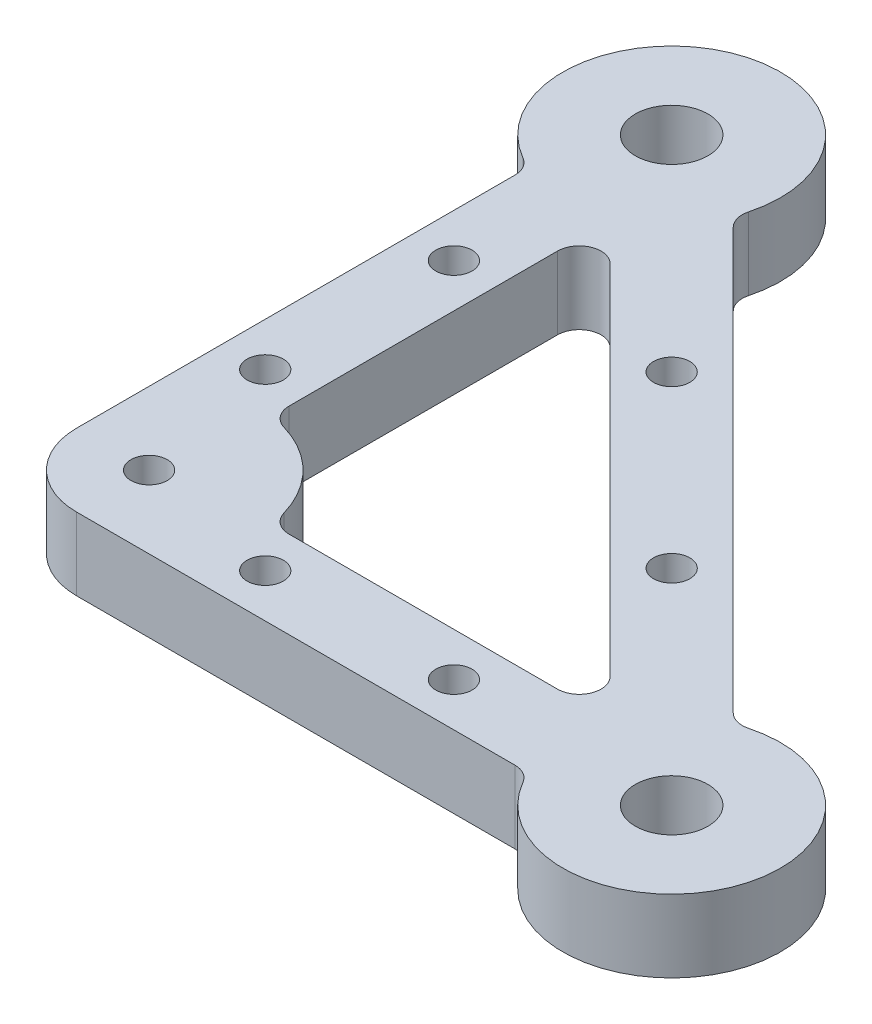
ISO-10303-21;
HEADER;
FILE_DESCRIPTION(('STEP AP214'),'2;1');
FILE_NAME('part.step','',(''),(''),'','','');
FILE_SCHEMA(('AUTOMOTIVE_DESIGN { 1 0 10303 214 1 1 1 1 }'));
ENDSEC;
DATA;
#1=APPLICATION_CONTEXT('core data for automotive mechanical design processes');
#2=APPLICATION_PROTOCOL_DEFINITION('international standard','automotive_design',2000,#1);
#3=PRODUCT_CONTEXT('',#1,'mechanical');
#4=PRODUCT('Part','Part','',(#3));
#5=PRODUCT_RELATED_PRODUCT_CATEGORY('part','',(#4));
#6=PRODUCT_DEFINITION_FORMATION('','',#4);
#7=PRODUCT_DEFINITION_CONTEXT('part definition',#1,'design');
#8=PRODUCT_DEFINITION('design','',#6,#7);
#9=PRODUCT_DEFINITION_SHAPE('','',#8);
#10=(LENGTH_UNIT() NAMED_UNIT(*) SI_UNIT(.MILLI.,.METRE.));
#11=(NAMED_UNIT(*) PLANE_ANGLE_UNIT() SI_UNIT($,.RADIAN.));
#12=(NAMED_UNIT(*) SI_UNIT($,.STERADIAN.) SOLID_ANGLE_UNIT());
#13=UNCERTAINTY_MEASURE_WITH_UNIT(LENGTH_MEASURE(1.E-05),#10,'distance_accuracy_value','');
#14=(GEOMETRIC_REPRESENTATION_CONTEXT(3) GLOBAL_UNCERTAINTY_ASSIGNED_CONTEXT((#13)) GLOBAL_UNIT_ASSIGNED_CONTEXT((#10,
#11,#12)) REPRESENTATION_CONTEXT('',''));
#15=CARTESIAN_POINT('',(0.,0.,0.));
#16=DIRECTION('',(0.,0.,1.));
#17=DIRECTION('',(1.,0.,0.));
#18=AXIS2_PLACEMENT_3D('',#15,#16,#17);
#19=CARTESIAN_POINT('',(3.99999999999999,10.,-4.));
#20=DIRECTION('',(0.,-1.,0.));
#21=DIRECTION('',(0.,0.,-1.));
#22=AXIS2_PLACEMENT_3D('',#19,#20,#21);
#23=PLANE('',#22);
#24=CARTESIAN_POINT('',(80.,10.,0.));
#25=DIRECTION('',(0.,1.,0.));
#26=DIRECTION('',(0.,0.,1.));
#27=AXIS2_PLACEMENT_3D('',#24,#25,#26);
#28=CIRCLE('',#27,5.);
#29=CARTESIAN_POINT('',(80.,10.,5.));
#30=VERTEX_POINT('',#29);
#31=EDGE_CURVE('E262',#30,#30,#28,.T.);
#32=ORIENTED_EDGE('',*,*,#31,.F.);
#33=EDGE_LOOP('',(#32));
#34=FACE_BOUND('',#33,.T.);
#35=CARTESIAN_POINT('',(0.,10.,-80.));
#36=DIRECTION('',(0.,1.,0.));
#37=DIRECTION('',(0.,0.,1.));
#38=AXIS2_PLACEMENT_3D('',#35,#36,#37);
#39=CIRCLE('',#38,5.);
#40=CARTESIAN_POINT('',(0.,10.,-75.));
#41=VERTEX_POINT('',#40);
#42=EDGE_CURVE('E270',#41,#41,#39,.T.);
#43=ORIENTED_EDGE('',*,*,#42,.F.);
#44=EDGE_LOOP('',(#43));
#45=FACE_BOUND('',#44,.T.);
#46=CARTESIAN_POINT('',(3.99999999999999,10.,-4.));
#47=DIRECTION('',(0.,1.,0.));
#48=DIRECTION('',(0.,0.,-1.));
#49=AXIS2_PLACEMENT_3D('',#46,#47,#48);
#50=CIRCLE('',#49,10.);
#51=CARTESIAN_POINT('',(-6.,10.,-4.00000000000007));
#52=VERTEX_POINT('',#51);
#53=CARTESIAN_POINT('',(4.00000000000007,10.,6.));
#54=VERTEX_POINT('',#53);
#55=EDGE_CURVE('E278',#52,#54,#50,.T.);
#56=ORIENTED_EDGE('',*,*,#55,.T.);
#57=DIRECTION('',(1.,0.,0.));
#58=VECTOR('',#57,1.);
#59=CARTESIAN_POINT('',(64.4115427318801,10.,6.));
#60=LINE('',#59,#58);
#61=CARTESIAN_POINT('',(64.4115427318801,10.,6.));
#62=VERTEX_POINT('',#61);
#63=EDGE_CURVE('E282',#54,#62,#60,.T.);
#64=ORIENTED_EDGE('',*,*,#63,.T.);
#65=CARTESIAN_POINT('',(64.4115427318801,10.,9.));
#66=DIRECTION('',(0.,-1.,0.));
#67=DIRECTION('',(0.,0.,-1.));
#68=AXIS2_PLACEMENT_3D('',#65,#66,#67);
#69=CIRCLE('',#68,3.00000000000001);
#70=CARTESIAN_POINT('',(67.0096189432334,10.,7.5));
#71=VERTEX_POINT('',#70);
#72=EDGE_CURVE('E286',#62,#71,#69,.T.);
#73=ORIENTED_EDGE('',*,*,#72,.T.);
#74=CARTESIAN_POINT('',(80.,10.,0.));
#75=DIRECTION('',(0.,1.,0.));
#76=DIRECTION('',(0.,0.,1.));
#77=AXIS2_PLACEMENT_3D('',#74,#75,#76);
#78=CIRCLE('',#77,15.);
#79=CARTESIAN_POINT('',(76.1177143234622,10.,-14.488887394336));
#80=VERTEX_POINT('',#79);
#81=EDGE_CURVE('E289',#71,#80,#78,.T.);
#82=ORIENTED_EDGE('',*,*,#81,.T.);
#83=CARTESIAN_POINT('',(75.3412571881546,10.,-17.3866648732032));
#84=DIRECTION('',(0.,-1.,0.));
#85=DIRECTION('',(0.,0.,1.));
#86=AXIS2_PLACEMENT_3D('',#83,#84,#85);
#87=CIRCLE('',#86,3.);
#88=CARTESIAN_POINT('',(73.219936844595,10.,-15.2653445296436));
#89=VERTEX_POINT('',#88);
#90=EDGE_CURVE('E292',#80,#89,#87,.T.);
#91=ORIENTED_EDGE('',*,*,#90,.T.);
#92=DIRECTION('',(-0.707106781186547,0.,-0.707106781186547));
#93=VECTOR('',#92,1.);
#94=CARTESIAN_POINT('',(73.219936844595,10.,-15.2653445296436));
#95=LINE('',#94,#93);
#96=CARTESIAN_POINT('',(15.2653445296436,10.,-73.219936844595));
#97=VERTEX_POINT('',#96);
#98=EDGE_CURVE('E295',#89,#97,#95,.T.);
#99=ORIENTED_EDGE('',*,*,#98,.T.);
#100=CARTESIAN_POINT('',(17.3866648732032,10.,-75.3412571881546));
#101=DIRECTION('',(0.,-1.,0.));
#102=DIRECTION('',(0.,0.,-1.));
#103=AXIS2_PLACEMENT_3D('',#100,#101,#102);
#104=CIRCLE('',#103,3.);
#105=CARTESIAN_POINT('',(14.488887394336,10.,-76.1177143234622));
#106=VERTEX_POINT('',#105);
#107=EDGE_CURVE('E298',#97,#106,#104,.T.);
#108=ORIENTED_EDGE('',*,*,#107,.T.);
#109=CARTESIAN_POINT('',(0.,10.,-80.));
#110=DIRECTION('',(0.,1.,0.));
#111=DIRECTION('',(0.,0.,1.));
#112=AXIS2_PLACEMENT_3D('',#109,#110,#111);
#113=CIRCLE('',#112,15.);
#114=CARTESIAN_POINT('',(-7.50000000000001,10.,-67.0096189432334));
#115=VERTEX_POINT('',#114);
#116=EDGE_CURVE('E301',#106,#115,#113,.T.);
#117=ORIENTED_EDGE('',*,*,#116,.T.);
#118=CARTESIAN_POINT('',(-9.,10.,-64.4115427318801));
#119=DIRECTION('',(0.,-1.,0.));
#120=DIRECTION('',(0.,0.,1.));
#121=AXIS2_PLACEMENT_3D('',#118,#119,#120);
#122=CIRCLE('',#121,3.00000000000001);
#123=CARTESIAN_POINT('',(-5.99999999999999,10.,-64.4115427318801));
#124=VERTEX_POINT('',#123);
#125=EDGE_CURVE('E304',#115,#124,#122,.T.);
#126=ORIENTED_EDGE('',*,*,#125,.T.);
#127=DIRECTION('',(0.,0.,1.));
#128=VECTOR('',#127,1.);
#129=CARTESIAN_POINT('',(-6.,10.,-64.4115427318801));
#130=LINE('',#129,#128);
#131=EDGE_CURVE('E307',#124,#52,#130,.T.);
#132=ORIENTED_EDGE('',*,*,#131,.T.);
#133=EDGE_LOOP('',(#56,#64,#73,#82,#91,#99,#108,#117,#126,#132));
#134=FACE_BOUND('',#133,.T.);
#135=CARTESIAN_POINT('',(9.00000000000001,10.,-21.2916164657906));
#136=DIRECTION('',(0.,1.,0.));
#137=DIRECTION('',(0.,0.,1.));
#138=AXIS2_PLACEMENT_3D('',#135,#136,#137);
#139=CIRCLE('',#138,3.);
#140=CARTESIAN_POINT('',(6.,10.,-21.2916164657906));
#141=VERTEX_POINT('',#140);
#142=CARTESIAN_POINT('',(8.16666666666667,10.,-18.4096803881588));
#143=VERTEX_POINT('',#142);
#144=EDGE_CURVE('E168',#141,#143,#139,.T.);
#145=ORIENTED_EDGE('',*,*,#144,.F.);
#146=DIRECTION('',(0.,0.,1.));
#147=VECTOR('',#146,1.);
#148=CARTESIAN_POINT('',(6.00000000000001,10.,-58.272077938642));
#149=LINE('',#148,#147);
#150=CARTESIAN_POINT('',(6.00000000000001,10.,-58.272077938642));
#151=VERTEX_POINT('',#150);
#152=EDGE_CURVE('E213',#151,#141,#149,.T.);
#153=ORIENTED_EDGE('',*,*,#152,.F.);
#154=CARTESIAN_POINT('',(9.00000000000001,10.,-58.2720779386421));
#155=DIRECTION('',(0.,1.,0.));
#156=DIRECTION('',(0.,0.,1.));
#157=AXIS2_PLACEMENT_3D('',#154,#155,#156);
#158=CIRCLE('',#157,3.);
#159=CARTESIAN_POINT('',(11.1213203435597,10.,-60.3933982822017));
#160=VERTEX_POINT('',#159);
#161=EDGE_CURVE('E210',#160,#151,#158,.T.);
#162=ORIENTED_EDGE('',*,*,#161,.F.);
#163=DIRECTION('',(-0.707106781186548,0.,-0.707106781186548));
#164=VECTOR('',#163,1.);
#165=CARTESIAN_POINT('',(60.3933982822017,10.,-11.1213203435597));
#166=LINE('',#165,#164);
#167=CARTESIAN_POINT('',(60.3933982822017,10.,-11.1213203435597));
#168=VERTEX_POINT('',#167);
#169=EDGE_CURVE('E207',#168,#160,#166,.T.);
#170=ORIENTED_EDGE('',*,*,#169,.F.);
#171=CARTESIAN_POINT('',(58.2720779386421,10.,-9.));
#172=DIRECTION('',(0.,1.,0.));
#173=DIRECTION('',(0.,0.,-1.));
#174=AXIS2_PLACEMENT_3D('',#171,#172,#173);
#175=CIRCLE('',#174,3.);
#176=CARTESIAN_POINT('',(58.2720779386421,10.,-6.));
#177=VERTEX_POINT('',#176);
#178=EDGE_CURVE('E204',#177,#168,#175,.T.);
#179=ORIENTED_EDGE('',*,*,#178,.F.);
#180=DIRECTION('',(1.,0.,0.));
#181=VECTOR('',#180,1.);
#182=CARTESIAN_POINT('',(21.2916164657906,10.,-6.));
#183=LINE('',#182,#181);
#184=CARTESIAN_POINT('',(21.2916164657906,10.,-6.));
#185=VERTEX_POINT('',#184);
#186=EDGE_CURVE('E198',#185,#177,#183,.T.);
#187=ORIENTED_EDGE('',*,*,#186,.F.);
#188=CARTESIAN_POINT('',(21.2916164657906,10.,-9.));
#189=DIRECTION('',(0.,1.,0.));
#190=DIRECTION('',(0.,0.,-1.));
#191=AXIS2_PLACEMENT_3D('',#188,#189,#190);
#192=CIRCLE('',#191,3.);
#193=CARTESIAN_POINT('',(18.4096803881588,10.,-8.16666666666667));
#194=VERTEX_POINT('',#193);
#195=EDGE_CURVE('E192',#194,#185,#192,.T.);
#196=ORIENTED_EDGE('',*,*,#195,.F.);
#197=CARTESIAN_POINT('',(4.,10.,-4.));
#198=DIRECTION('',(0.,-1.,0.));
#199=DIRECTION('',(0.,0.,1.));
#200=AXIS2_PLACEMENT_3D('',#197,#198,#199);
#201=CIRCLE('',#200,15.);
#202=EDGE_CURVE('E177',#143,#194,#201,.T.);
#203=ORIENTED_EDGE('',*,*,#202,.F.);
#204=EDGE_LOOP('',(#145,#153,#162,#170,#179,#187,#196,#203));
#205=FACE_BOUND('',#204,.T.);
#206=CARTESIAN_POINT('',(28.2842712474619,10.,-51.7157287525381));
#207=DIRECTION('',(0.,1.,0.));
#208=DIRECTION('',(0.,0.,1.));
#209=AXIS2_PLACEMENT_3D('',#206,#207,#208);
#210=CIRCLE('',#209,2.5);
#211=CARTESIAN_POINT('',(28.2842712474619,10.,-49.2157287525381));
#212=VERTEX_POINT('',#211);
#213=EDGE_CURVE('E218',#212,#212,#210,.T.);
#214=ORIENTED_EDGE('',*,*,#213,.F.);
#215=EDGE_LOOP('',(#214));
#216=FACE_BOUND('',#215,.T.);
#217=CARTESIAN_POINT('',(51.7157287525381,10.,-28.2842712474619));
#218=DIRECTION('',(0.,1.,0.));
#219=DIRECTION('',(0.,0.,1.));
#220=AXIS2_PLACEMENT_3D('',#217,#218,#219);
#221=CIRCLE('',#220,2.5);
#222=CARTESIAN_POINT('',(51.7157287525381,10.,-25.7842712474619));
#223=VERTEX_POINT('',#222);
#224=EDGE_CURVE('E794',#223,#223,#221,.T.);
#225=ORIENTED_EDGE('',*,*,#224,.F.);
#226=EDGE_LOOP('',(#225));
#227=FACE_BOUND('',#226,.T.);
#228=CARTESIAN_POINT('',(4.,10.,-4.));
#229=DIRECTION('',(0.,1.,0.));
#230=DIRECTION('',(0.,0.,1.));
#231=AXIS2_PLACEMENT_3D('',#228,#229,#230);
#232=CIRCLE('',#231,2.5);
#233=CARTESIAN_POINT('',(4.,10.,-1.5));
#234=VERTEX_POINT('',#233);
#235=EDGE_CURVE('E786',#234,#234,#232,.T.);
#236=ORIENTED_EDGE('',*,*,#235,.F.);
#237=EDGE_LOOP('',(#236));
#238=FACE_BOUND('',#237,.T.);
#239=CARTESIAN_POINT('',(24.,10.,0.));
#240=DIRECTION('',(0.,1.,0.));
#241=DIRECTION('',(0.,0.,1.));
#242=AXIS2_PLACEMENT_3D('',#239,#240,#241);
#243=CIRCLE('',#242,2.5);
#244=CARTESIAN_POINT('',(24.,10.,2.5));
#245=VERTEX_POINT('',#244);
#246=EDGE_CURVE('E778',#245,#245,#243,.T.);
#247=ORIENTED_EDGE('',*,*,#246,.F.);
#248=EDGE_LOOP('',(#247));
#249=FACE_BOUND('',#248,.T.);
#250=CARTESIAN_POINT('',(50.,10.,0.));
#251=DIRECTION('',(0.,1.,0.));
#252=DIRECTION('',(0.,0.,1.));
#253=AXIS2_PLACEMENT_3D('',#250,#251,#252);
#254=CIRCLE('',#253,2.5);
#255=CARTESIAN_POINT('',(50.,10.,2.5));
#256=VERTEX_POINT('',#255);
#257=EDGE_CURVE('E770',#256,#256,#254,.T.);
#258=ORIENTED_EDGE('',*,*,#257,.F.);
#259=EDGE_LOOP('',(#258));
#260=FACE_BOUND('',#259,.T.);
#261=CARTESIAN_POINT('',(0.,10.,-24.));
#262=DIRECTION('',(0.,1.,0.));
#263=DIRECTION('',(0.,0.,1.));
#264=AXIS2_PLACEMENT_3D('',#261,#262,#263);
#265=CIRCLE('',#264,2.5);
#266=CARTESIAN_POINT('',(0.,10.,-21.5));
#267=VERTEX_POINT('',#266);
#268=EDGE_CURVE('E762',#267,#267,#265,.T.);
#269=ORIENTED_EDGE('',*,*,#268,.F.);
#270=EDGE_LOOP('',(#269));
#271=FACE_BOUND('',#270,.T.);
#272=CARTESIAN_POINT('',(0.,10.,-50.));
#273=DIRECTION('',(0.,1.,0.));
#274=DIRECTION('',(0.,0.,1.));
#275=AXIS2_PLACEMENT_3D('',#272,#273,#274);
#276=CIRCLE('',#275,2.5);
#277=CARTESIAN_POINT('',(0.,10.,-47.5));
#278=VERTEX_POINT('',#277);
#279=EDGE_CURVE('E749',#278,#278,#276,.T.);
#280=ORIENTED_EDGE('',*,*,#279,.F.);
#281=EDGE_LOOP('',(#280));
#282=FACE_BOUND('',#281,.T.);
#283=ADVANCED_FACE('F42',(#34,#45,#134,#205,#216,#227,#238,#249,#260,#271,#282),#23,.F.);
#284=CARTESIAN_POINT('',(3.99999999999999,0.,-4.));
#285=DIRECTION('',(0.,-1.,0.));
#286=DIRECTION('',(0.,0.,-1.));
#287=AXIS2_PLACEMENT_3D('',#284,#285,#286);
#288=PLANE('',#287);
#289=CARTESIAN_POINT('',(0.,0.,-24.));
#290=DIRECTION('',(0.,1.,0.));
#291=DIRECTION('',(0.,0.,1.));
#292=AXIS2_PLACEMENT_3D('',#289,#290,#291);
#293=CIRCLE('',#292,2.5);
#294=CARTESIAN_POINT('',(0.,0.,-21.5));
#295=VERTEX_POINT('',#294);
#296=EDGE_CURVE('E759',#295,#295,#293,.T.);
#297=ORIENTED_EDGE('',*,*,#296,.T.);
#298=EDGE_LOOP('',(#297));
#299=FACE_BOUND('',#298,.T.);
#300=CARTESIAN_POINT('',(24.,0.,0.));
#301=DIRECTION('',(0.,1.,0.));
#302=DIRECTION('',(0.,0.,1.));
#303=AXIS2_PLACEMENT_3D('',#300,#301,#302);
#304=CIRCLE('',#303,2.5);
#305=CARTESIAN_POINT('',(24.,0.,2.5));
#306=VERTEX_POINT('',#305);
#307=EDGE_CURVE('E774',#306,#306,#304,.T.);
#308=ORIENTED_EDGE('',*,*,#307,.T.);
#309=EDGE_LOOP('',(#308));
#310=FACE_BOUND('',#309,.T.);
#311=CARTESIAN_POINT('',(51.7157287525381,0.,-28.2842712474619));
#312=DIRECTION('',(0.,1.,0.));
#313=DIRECTION('',(0.,0.,1.));
#314=AXIS2_PLACEMENT_3D('',#311,#312,#313);
#315=CIRCLE('',#314,2.5);
#316=CARTESIAN_POINT('',(51.7157287525381,0.,-25.7842712474619));
#317=VERTEX_POINT('',#316);
#318=EDGE_CURVE('E790',#317,#317,#315,.T.);
#319=ORIENTED_EDGE('',*,*,#318,.T.);
#320=EDGE_LOOP('',(#319));
#321=FACE_BOUND('',#320,.T.);
#322=DIRECTION('',(0.,0.,1.));
#323=VECTOR('',#322,1.);
#324=CARTESIAN_POINT('',(6.00000000000001,0.,-58.272077938642));
#325=LINE('',#324,#323);
#326=CARTESIAN_POINT('',(6.00000000000001,0.,-58.272077938642));
#327=VERTEX_POINT('',#326);
#328=CARTESIAN_POINT('',(6.,0.,-21.2916164657906));
#329=VERTEX_POINT('',#328);
#330=EDGE_CURVE('E178',#327,#329,#325,.T.);
#331=ORIENTED_EDGE('',*,*,#330,.T.);
#332=CARTESIAN_POINT('',(9.00000000000001,0.,-21.2916164657906));
#333=DIRECTION('',(0.,1.,0.));
#334=DIRECTION('',(0.,0.,1.));
#335=AXIS2_PLACEMENT_3D('',#332,#333,#334);
#336=CIRCLE('',#335,3.);
#337=CARTESIAN_POINT('',(8.16666666666667,0.,-18.4096803881588));
#338=VERTEX_POINT('',#337);
#339=EDGE_CURVE('E66',#329,#338,#336,.T.);
#340=ORIENTED_EDGE('',*,*,#339,.T.);
#341=CARTESIAN_POINT('',(4.,0.,-4.));
#342=DIRECTION('',(0.,-1.,0.));
#343=DIRECTION('',(0.,0.,1.));
#344=AXIS2_PLACEMENT_3D('',#341,#342,#343);
#345=CIRCLE('',#344,15.);
#346=CARTESIAN_POINT('',(18.4096803881588,0.,-8.16666666666667));
#347=VERTEX_POINT('',#346);
#348=EDGE_CURVE('E184',#338,#347,#345,.T.);
#349=ORIENTED_EDGE('',*,*,#348,.T.);
#350=CARTESIAN_POINT('',(21.2916164657906,0.,-9.));
#351=DIRECTION('',(0.,1.,0.));
#352=DIRECTION('',(0.,0.,-1.));
#353=AXIS2_PLACEMENT_3D('',#350,#351,#352);
#354=CIRCLE('',#353,3.);
#355=CARTESIAN_POINT('',(21.2916164657906,0.,-6.));
#356=VERTEX_POINT('',#355);
#357=EDGE_CURVE('E221',#347,#356,#354,.T.);
#358=ORIENTED_EDGE('',*,*,#357,.T.);
#359=DIRECTION('',(1.,0.,0.));
#360=VECTOR('',#359,1.);
#361=CARTESIAN_POINT('',(21.2916164657906,0.,-6.));
#362=LINE('',#361,#360);
#363=CARTESIAN_POINT('',(58.2720779386421,0.,-6.));
#364=VERTEX_POINT('',#363);
#365=EDGE_CURVE('E225',#356,#364,#362,.T.);
#366=ORIENTED_EDGE('',*,*,#365,.T.);
#367=CARTESIAN_POINT('',(58.2720779386421,0.,-9.));
#368=DIRECTION('',(0.,1.,0.));
#369=DIRECTION('',(0.,0.,-1.));
#370=AXIS2_PLACEMENT_3D('',#367,#368,#369);
#371=CIRCLE('',#370,3.);
#372=CARTESIAN_POINT('',(60.3933982822017,0.,-11.1213203435597));
#373=VERTEX_POINT('',#372);
#374=EDGE_CURVE('E229',#364,#373,#371,.T.);
#375=ORIENTED_EDGE('',*,*,#374,.T.);
#376=DIRECTION('',(-0.707106781186548,0.,-0.707106781186548));
#377=VECTOR('',#376,1.);
#378=CARTESIAN_POINT('',(60.3933982822017,0.,-11.1213203435597));
#379=LINE('',#378,#377);
#380=CARTESIAN_POINT('',(11.1213203435597,0.,-60.3933982822017));
#381=VERTEX_POINT('',#380);
#382=EDGE_CURVE('E233',#373,#381,#379,.T.);
#383=ORIENTED_EDGE('',*,*,#382,.T.);
#384=CARTESIAN_POINT('',(9.00000000000001,0.,-58.2720779386421));
#385=DIRECTION('',(0.,1.,0.));
#386=DIRECTION('',(0.,0.,1.));
#387=AXIS2_PLACEMENT_3D('',#384,#385,#386);
#388=CIRCLE('',#387,3.);
#389=EDGE_CURVE('E237',#381,#327,#388,.T.);
#390=ORIENTED_EDGE('',*,*,#389,.T.);
#391=EDGE_LOOP('',(#331,#340,#349,#358,#366,#375,#383,#390));
#392=FACE_BOUND('',#391,.T.);
#393=CARTESIAN_POINT('',(80.,0.,0.));
#394=DIRECTION('',(0.,1.,0.));
#395=DIRECTION('',(0.,0.,1.));
#396=AXIS2_PLACEMENT_3D('',#393,#394,#395);
#397=CIRCLE('',#396,5.);
#398=CARTESIAN_POINT('',(80.,0.,5.));
#399=VERTEX_POINT('',#398);
#400=EDGE_CURVE('E186',#399,#399,#397,.T.);
#401=ORIENTED_EDGE('',*,*,#400,.T.);
#402=EDGE_LOOP('',(#401));
#403=FACE_BOUND('',#402,.T.);
#404=CARTESIAN_POINT('',(3.99999999999999,0.,-4.));
#405=DIRECTION('',(0.,1.,0.));
#406=DIRECTION('',(0.,0.,-1.));
#407=AXIS2_PLACEMENT_3D('',#404,#405,#406);
#408=CIRCLE('',#407,10.);
#409=CARTESIAN_POINT('',(-6.,0.,-4.00000000000007));
#410=VERTEX_POINT('',#409);
#411=CARTESIAN_POINT('',(4.00000000000007,0.,6.));
#412=VERTEX_POINT('',#411);
#413=EDGE_CURVE('E274',#410,#412,#408,.T.);
#414=ORIENTED_EDGE('',*,*,#413,.F.);
#415=DIRECTION('',(0.,0.,1.));
#416=VECTOR('',#415,1.);
#417=CARTESIAN_POINT('',(-6.,0.,-64.4115427318801));
#418=LINE('',#417,#416);
#419=CARTESIAN_POINT('',(-5.99999999999999,0.,-64.4115427318801));
#420=VERTEX_POINT('',#419);
#421=EDGE_CURVE('E283',#420,#410,#418,.T.);
#422=ORIENTED_EDGE('',*,*,#421,.F.);
#423=CARTESIAN_POINT('',(-9.,0.,-64.4115427318801));
#424=DIRECTION('',(0.,-1.,0.));
#425=DIRECTION('',(0.,0.,1.));
#426=AXIS2_PLACEMENT_3D('',#423,#424,#425);
#427=CIRCLE('',#426,3.00000000000001);
#428=CARTESIAN_POINT('',(-7.50000000000001,0.,-67.0096189432334));
#429=VERTEX_POINT('',#428);
#430=EDGE_CURVE('E335',#429,#420,#427,.T.);
#431=ORIENTED_EDGE('',*,*,#430,.F.);
#432=CARTESIAN_POINT('',(0.,0.,-80.));
#433=DIRECTION('',(0.,1.,0.));
#434=DIRECTION('',(0.,0.,1.));
#435=AXIS2_PLACEMENT_3D('',#432,#433,#434);
#436=CIRCLE('',#435,15.);
#437=CARTESIAN_POINT('',(14.488887394336,0.,-76.1177143234622));
#438=VERTEX_POINT('',#437);
#439=EDGE_CURVE('E332',#438,#429,#436,.T.);
#440=ORIENTED_EDGE('',*,*,#439,.F.);
#441=CARTESIAN_POINT('',(17.3866648732032,0.,-75.3412571881546));
#442=DIRECTION('',(0.,-1.,0.));
#443=DIRECTION('',(0.,0.,-1.));
#444=AXIS2_PLACEMENT_3D('',#441,#442,#443);
#445=CIRCLE('',#444,3.);
#446=CARTESIAN_POINT('',(15.2653445296436,0.,-73.219936844595));
#447=VERTEX_POINT('',#446);
#448=EDGE_CURVE('E329',#447,#438,#445,.T.);
#449=ORIENTED_EDGE('',*,*,#448,.F.);
#450=DIRECTION('',(-0.707106781186547,0.,-0.707106781186547));
#451=VECTOR('',#450,1.);
#452=CARTESIAN_POINT('',(73.219936844595,0.,-15.2653445296436));
#453=LINE('',#452,#451);
#454=CARTESIAN_POINT('',(73.219936844595,0.,-15.2653445296436));
#455=VERTEX_POINT('',#454);
#456=EDGE_CURVE('E326',#455,#447,#453,.T.);
#457=ORIENTED_EDGE('',*,*,#456,.F.);
#458=CARTESIAN_POINT('',(75.3412571881546,0.,-17.3866648732032));
#459=DIRECTION('',(0.,-1.,0.));
#460=DIRECTION('',(0.,0.,1.));
#461=AXIS2_PLACEMENT_3D('',#458,#459,#460);
#462=CIRCLE('',#461,3.);
#463=CARTESIAN_POINT('',(76.1177143234622,0.,-14.488887394336));
#464=VERTEX_POINT('',#463);
#465=EDGE_CURVE('E323',#464,#455,#462,.T.);
#466=ORIENTED_EDGE('',*,*,#465,.F.);
#467=CARTESIAN_POINT('',(80.,0.,0.));
#468=DIRECTION('',(0.,1.,0.));
#469=DIRECTION('',(0.,0.,1.));
#470=AXIS2_PLACEMENT_3D('',#467,#468,#469);
#471=CIRCLE('',#470,15.);
#472=CARTESIAN_POINT('',(67.0096189432334,0.,7.5));
#473=VERTEX_POINT('',#472);
#474=EDGE_CURVE('E320',#473,#464,#471,.T.);
#475=ORIENTED_EDGE('',*,*,#474,.F.);
#476=CARTESIAN_POINT('',(64.4115427318801,0.,9.));
#477=DIRECTION('',(0.,-1.,0.));
#478=DIRECTION('',(0.,0.,-1.));
#479=AXIS2_PLACEMENT_3D('',#476,#477,#478);
#480=CIRCLE('',#479,3.00000000000001);
#481=CARTESIAN_POINT('',(64.4115427318801,0.,6.));
#482=VERTEX_POINT('',#481);
#483=EDGE_CURVE('E317',#482,#473,#480,.T.);
#484=ORIENTED_EDGE('',*,*,#483,.F.);
#485=DIRECTION('',(1.,0.,0.));
#486=VECTOR('',#485,1.);
#487=CARTESIAN_POINT('',(64.4115427318801,0.,6.));
#488=LINE('',#487,#486);
#489=EDGE_CURVE('E314',#412,#482,#488,.T.);
#490=ORIENTED_EDGE('',*,*,#489,.F.);
#491=EDGE_LOOP('',(#414,#422,#431,#440,#449,#457,#466,#475,#484,#490));
#492=FACE_BOUND('',#491,.T.);
#493=CARTESIAN_POINT('',(0.,0.,-80.));
#494=DIRECTION('',(0.,1.,0.));
#495=DIRECTION('',(0.,0.,1.));
#496=AXIS2_PLACEMENT_3D('',#493,#494,#495);
#497=CIRCLE('',#496,5.);
#498=CARTESIAN_POINT('',(0.,0.,-75.));
#499=VERTEX_POINT('',#498);
#500=EDGE_CURVE('E266',#499,#499,#497,.T.);
#501=ORIENTED_EDGE('',*,*,#500,.T.);
#502=EDGE_LOOP('',(#501));
#503=FACE_BOUND('',#502,.T.);
#504=CARTESIAN_POINT('',(28.2842712474619,0.,-51.7157287525381));
#505=DIRECTION('',(0.,1.,0.));
#506=DIRECTION('',(0.,0.,1.));
#507=AXIS2_PLACEMENT_3D('',#504,#505,#506);
#508=CIRCLE('',#507,2.5);
#509=CARTESIAN_POINT('',(28.2842712474619,0.,-49.2157287525381));
#510=VERTEX_POINT('',#509);
#511=EDGE_CURVE('E798',#510,#510,#508,.T.);
#512=ORIENTED_EDGE('',*,*,#511,.T.);
#513=EDGE_LOOP('',(#512));
#514=FACE_BOUND('',#513,.T.);
#515=CARTESIAN_POINT('',(4.,0.,-4.));
#516=DIRECTION('',(0.,1.,0.));
#517=DIRECTION('',(0.,0.,1.));
#518=AXIS2_PLACEMENT_3D('',#515,#516,#517);
#519=CIRCLE('',#518,2.5);
#520=CARTESIAN_POINT('',(4.,0.,-1.5));
#521=VERTEX_POINT('',#520);
#522=EDGE_CURVE('E782',#521,#521,#519,.T.);
#523=ORIENTED_EDGE('',*,*,#522,.T.);
#524=EDGE_LOOP('',(#523));
#525=FACE_BOUND('',#524,.T.);
#526=CARTESIAN_POINT('',(50.,0.,0.));
#527=DIRECTION('',(0.,1.,0.));
#528=DIRECTION('',(0.,0.,1.));
#529=AXIS2_PLACEMENT_3D('',#526,#527,#528);
#530=CIRCLE('',#529,2.5);
#531=CARTESIAN_POINT('',(50.,0.,2.5));
#532=VERTEX_POINT('',#531);
#533=EDGE_CURVE('E766',#532,#532,#530,.T.);
#534=ORIENTED_EDGE('',*,*,#533,.T.);
#535=EDGE_LOOP('',(#534));
#536=FACE_BOUND('',#535,.T.);
#537=CARTESIAN_POINT('',(0.,0.,-50.));
#538=DIRECTION('',(0.,1.,0.));
#539=DIRECTION('',(0.,0.,1.));
#540=AXIS2_PLACEMENT_3D('',#537,#538,#539);
#541=CIRCLE('',#540,2.5);
#542=CARTESIAN_POINT('',(0.,0.,-47.5));
#543=VERTEX_POINT('',#542);
#544=EDGE_CURVE('E752',#543,#543,#541,.T.);
#545=ORIENTED_EDGE('',*,*,#544,.T.);
#546=EDGE_LOOP('',(#545));
#547=FACE_BOUND('',#546,.T.);
#548=ADVANCED_FACE('F384',(#299,#310,#321,#392,#403,#492,#503,#514,#525,#536,#547),#288,.T.);
#549=CARTESIAN_POINT('',(3.99999999999999,10.,-4.));
#550=DIRECTION('',(0.,-1.,0.));
#551=DIRECTION('',(0.,0.,-1.));
#552=AXIS2_PLACEMENT_3D('',#549,#550,#551);
#553=CYLINDRICAL_SURFACE('',#552,10.);
#554=ORIENTED_EDGE('',*,*,#413,.T.);
#555=DIRECTION('',(0.,-1.,0.));
#556=VECTOR('',#555,1.);
#557=CARTESIAN_POINT('',(4.00000000000007,10.,6.));
#558=LINE('',#557,#556);
#559=EDGE_CURVE('E11',#54,#412,#558,.T.);
#560=ORIENTED_EDGE('',*,*,#559,.F.);
#561=ORIENTED_EDGE('',*,*,#55,.F.);
#562=DIRECTION('',(0.,-1.,0.));
#563=VECTOR('',#562,1.);
#564=CARTESIAN_POINT('',(-6.,10.,-4.00000000000007));
#565=LINE('',#564,#563);
#566=EDGE_CURVE('E310',#52,#410,#565,.T.);
#567=ORIENTED_EDGE('',*,*,#566,.T.);
#568=EDGE_LOOP('',(#554,#560,#561,#567));
#569=FACE_BOUND('',#568,.T.);
#570=ADVANCED_FACE('F44',(#569),#553,.T.);
#571=CARTESIAN_POINT('',(64.4115427318801,10.,6.));
#572=DIRECTION('',(0.,0.,-1.));
#573=DIRECTION('',(-1.,0.,0.));
#574=AXIS2_PLACEMENT_3D('',#571,#572,#573);
#575=PLANE('',#574);
#576=ORIENTED_EDGE('',*,*,#489,.T.);
#577=DIRECTION('',(0.,-1.,0.));
#578=VECTOR('',#577,1.);
#579=CARTESIAN_POINT('',(64.4115427318801,10.,6.));
#580=LINE('',#579,#578);
#581=EDGE_CURVE('E51',#62,#482,#580,.T.);
#582=ORIENTED_EDGE('',*,*,#581,.F.);
#583=ORIENTED_EDGE('',*,*,#63,.F.);
#584=ORIENTED_EDGE('',*,*,#559,.T.);
#585=EDGE_LOOP('',(#576,#582,#583,#584));
#586=FACE_BOUND('',#585,.T.);
#587=ADVANCED_FACE('F401',(#586),#575,.F.);
#588=CARTESIAN_POINT('',(64.4115427318801,10.,9.));
#589=DIRECTION('',(0.,-1.,0.));
#590=DIRECTION('',(0.,0.,-1.));
#591=AXIS2_PLACEMENT_3D('',#588,#589,#590);
#592=CYLINDRICAL_SURFACE('',#591,3.00000000000001);
#593=ORIENTED_EDGE('',*,*,#483,.T.);
#594=DIRECTION('',(0.,-1.,0.));
#595=VECTOR('',#594,1.);
#596=CARTESIAN_POINT('',(67.0096189432334,10.,7.5));
#597=LINE('',#596,#595);
#598=EDGE_CURVE('E367',#71,#473,#597,.T.);
#599=ORIENTED_EDGE('',*,*,#598,.F.);
#600=ORIENTED_EDGE('',*,*,#72,.F.);
#601=ORIENTED_EDGE('',*,*,#581,.T.);
#602=EDGE_LOOP('',(#593,#599,#600,#601));
#603=FACE_BOUND('',#602,.T.);
#604=ADVANCED_FACE('F378',(#603),#592,.F.);
#605=CARTESIAN_POINT('',(80.,10.,0.));
#606=DIRECTION('',(0.,-1.,0.));
#607=DIRECTION('',(0.,0.,-1.));
#608=AXIS2_PLACEMENT_3D('',#605,#606,#607);
#609=CYLINDRICAL_SURFACE('',#608,15.);
#610=ORIENTED_EDGE('',*,*,#474,.T.);
#611=DIRECTION('',(0.,-1.,0.));
#612=VECTOR('',#611,1.);
#613=CARTESIAN_POINT('',(76.1177143234622,10.,-14.488887394336));
#614=LINE('',#613,#612);
#615=EDGE_CURVE('E363',#80,#464,#614,.T.);
#616=ORIENTED_EDGE('',*,*,#615,.F.);
#617=ORIENTED_EDGE('',*,*,#81,.F.);
#618=ORIENTED_EDGE('',*,*,#598,.T.);
#619=EDGE_LOOP('',(#610,#616,#617,#618));
#620=FACE_BOUND('',#619,.T.);
#621=ADVANCED_FACE('F390',(#620),#609,.T.);
#622=CARTESIAN_POINT('',(75.3412571881546,10.,-17.3866648732032));
#623=DIRECTION('',(0.,-1.,0.));
#624=DIRECTION('',(0.,0.,-1.));
#625=AXIS2_PLACEMENT_3D('',#622,#623,#624);
#626=CYLINDRICAL_SURFACE('',#625,3.);
#627=ORIENTED_EDGE('',*,*,#465,.T.);
#628=DIRECTION('',(0.,-1.,0.));
#629=VECTOR('',#628,1.);
#630=CARTESIAN_POINT('',(73.219936844595,10.,-15.2653445296436));
#631=LINE('',#630,#629);
#632=EDGE_CURVE('E359',#89,#455,#631,.T.);
#633=ORIENTED_EDGE('',*,*,#632,.F.);
#634=ORIENTED_EDGE('',*,*,#90,.F.);
#635=ORIENTED_EDGE('',*,*,#615,.T.);
#636=EDGE_LOOP('',(#627,#633,#634,#635));
#637=FACE_BOUND('',#636,.T.);
#638=ADVANCED_FACE('F394',(#637),#626,.F.);
#639=CARTESIAN_POINT('',(73.219936844595,10.,-15.2653445296436));
#640=DIRECTION('',(-0.707106781186548,0.,0.707106781186548));
#641=DIRECTION('',(0.707106781186548,0.,0.707106781186548));
#642=AXIS2_PLACEMENT_3D('',#639,#640,#641);
#643=PLANE('',#642);
#644=ORIENTED_EDGE('',*,*,#456,.T.);
#645=DIRECTION('',(0.,-1.,0.));
#646=VECTOR('',#645,1.);
#647=CARTESIAN_POINT('',(15.2653445296436,10.,-73.219936844595));
#648=LINE('',#647,#646);
#649=EDGE_CURVE('E355',#97,#447,#648,.T.);
#650=ORIENTED_EDGE('',*,*,#649,.F.);
#651=ORIENTED_EDGE('',*,*,#98,.F.);
#652=ORIENTED_EDGE('',*,*,#632,.T.);
#653=EDGE_LOOP('',(#644,#650,#651,#652));
#654=FACE_BOUND('',#653,.T.);
#655=ADVANCED_FACE('F424',(#654),#643,.F.);
#656=CARTESIAN_POINT('',(17.3866648732032,10.,-75.3412571881546));
#657=DIRECTION('',(0.,-1.,0.));
#658=DIRECTION('',(0.,0.,-1.));
#659=AXIS2_PLACEMENT_3D('',#656,#657,#658);
#660=CYLINDRICAL_SURFACE('',#659,3.);
#661=ORIENTED_EDGE('',*,*,#448,.T.);
#662=DIRECTION('',(0.,-1.,0.));
#663=VECTOR('',#662,1.);
#664=CARTESIAN_POINT('',(14.488887394336,10.,-76.1177143234622));
#665=LINE('',#664,#663);
#666=EDGE_CURVE('E351',#106,#438,#665,.T.);
#667=ORIENTED_EDGE('',*,*,#666,.F.);
#668=ORIENTED_EDGE('',*,*,#107,.F.);
#669=ORIENTED_EDGE('',*,*,#649,.T.);
#670=EDGE_LOOP('',(#661,#667,#668,#669));
#671=FACE_BOUND('',#670,.T.);
#672=ADVANCED_FACE('F421',(#671),#660,.F.);
#673=CARTESIAN_POINT('',(0.,10.,-80.));
#674=DIRECTION('',(0.,-1.,0.));
#675=DIRECTION('',(0.,0.,-1.));
#676=AXIS2_PLACEMENT_3D('',#673,#674,#675);
#677=CYLINDRICAL_SURFACE('',#676,15.);
#678=ORIENTED_EDGE('',*,*,#439,.T.);
#679=DIRECTION('',(0.,-1.,0.));
#680=VECTOR('',#679,1.);
#681=CARTESIAN_POINT('',(-7.50000000000001,10.,-67.0096189432334));
#682=LINE('',#681,#680);
#683=EDGE_CURVE('E347',#115,#429,#682,.T.);
#684=ORIENTED_EDGE('',*,*,#683,.F.);
#685=ORIENTED_EDGE('',*,*,#116,.F.);
#686=ORIENTED_EDGE('',*,*,#666,.T.);
#687=EDGE_LOOP('',(#678,#684,#685,#686));
#688=FACE_BOUND('',#687,.T.);
#689=ADVANCED_FACE('F417',(#688),#677,.T.);
#690=CARTESIAN_POINT('',(-9.,10.,-64.4115427318801));
#691=DIRECTION('',(0.,-1.,0.));
#692=DIRECTION('',(0.,0.,-1.));
#693=AXIS2_PLACEMENT_3D('',#690,#691,#692);
#694=CYLINDRICAL_SURFACE('',#693,3.00000000000001);
#695=ORIENTED_EDGE('',*,*,#430,.T.);
#696=DIRECTION('',(0.,-1.,0.));
#697=VECTOR('',#696,1.);
#698=CARTESIAN_POINT('',(-5.99999999999999,10.,-64.4115427318801));
#699=LINE('',#698,#697);
#700=EDGE_CURVE('E343',#124,#420,#699,.T.);
#701=ORIENTED_EDGE('',*,*,#700,.F.);
#702=ORIENTED_EDGE('',*,*,#125,.F.);
#703=ORIENTED_EDGE('',*,*,#683,.T.);
#704=EDGE_LOOP('',(#695,#701,#702,#703));
#705=FACE_BOUND('',#704,.T.);
#706=ADVANCED_FACE('F413',(#705),#694,.F.);
#707=CARTESIAN_POINT('',(-6.,10.,-64.4115427318801));
#708=DIRECTION('',(1.,0.,0.));
#709=DIRECTION('',(0.,0.,-1.));
#710=AXIS2_PLACEMENT_3D('',#707,#708,#709);
#711=PLANE('',#710);
#712=ORIENTED_EDGE('',*,*,#421,.T.);
#713=ORIENTED_EDGE('',*,*,#566,.F.);
#714=ORIENTED_EDGE('',*,*,#131,.F.);
#715=ORIENTED_EDGE('',*,*,#700,.T.);
#716=EDGE_LOOP('',(#712,#713,#714,#715));
#717=FACE_BOUND('',#716,.T.);
#718=ADVANCED_FACE('F408',(#717),#711,.F.);
#719=CARTESIAN_POINT('',(0.,10.,-80.));
#720=DIRECTION('',(0.,-1.,0.));
#721=DIRECTION('',(0.,0.,-1.));
#722=AXIS2_PLACEMENT_3D('',#719,#720,#721);
#723=CYLINDRICAL_SURFACE('',#722,5.);
#724=ORIENTED_EDGE('',*,*,#42,.T.);
#725=EDGE_LOOP('',(#724));
#726=FACE_BOUND('',#725,.T.);
#727=ORIENTED_EDGE('',*,*,#500,.F.);
#728=EDGE_LOOP('',(#727));
#729=FACE_BOUND('',#728,.T.);
#730=ADVANCED_FACE('F444',(#726,#729),#723,.F.);
#731=CARTESIAN_POINT('',(80.,10.,0.));
#732=DIRECTION('',(0.,-1.,0.));
#733=DIRECTION('',(0.,0.,-1.));
#734=AXIS2_PLACEMENT_3D('',#731,#732,#733);
#735=CYLINDRICAL_SURFACE('',#734,5.);
#736=ORIENTED_EDGE('',*,*,#31,.T.);
#737=EDGE_LOOP('',(#736));
#738=FACE_BOUND('',#737,.T.);
#739=ORIENTED_EDGE('',*,*,#400,.F.);
#740=EDGE_LOOP('',(#739));
#741=FACE_BOUND('',#740,.T.);
#742=ADVANCED_FACE('F470',(#738,#741),#735,.F.);
#743=CARTESIAN_POINT('',(9.00000000000001,10.,-21.2916164657906));
#744=DIRECTION('',(0.,-1.,0.));
#745=DIRECTION('',(0.,0.,-1.));
#746=AXIS2_PLACEMENT_3D('',#743,#744,#745);
#747=CYLINDRICAL_SURFACE('',#746,3.);
#748=ORIENTED_EDGE('',*,*,#339,.F.);
#749=DIRECTION('',(0.,-1.,0.));
#750=VECTOR('',#749,1.);
#751=CARTESIAN_POINT('',(6.,10.,-21.2916164657906));
#752=LINE('',#751,#750);
#753=EDGE_CURVE('E172',#141,#329,#752,.T.);
#754=ORIENTED_EDGE('',*,*,#753,.F.);
#755=ORIENTED_EDGE('',*,*,#144,.T.);
#756=DIRECTION('',(0.,-1.,0.));
#757=VECTOR('',#756,1.);
#758=CARTESIAN_POINT('',(8.16666666666667,10.,-18.4096803881588));
#759=LINE('',#758,#757);
#760=EDGE_CURVE('E171',#143,#338,#759,.T.);
#761=ORIENTED_EDGE('',*,*,#760,.T.);
#762=EDGE_LOOP('',(#748,#754,#755,#761));
#763=FACE_BOUND('',#762,.T.);
#764=ADVANCED_FACE('F170',(#763),#747,.F.);
#765=CARTESIAN_POINT('',(4.,10.,-4.));
#766=DIRECTION('',(0.,-1.,0.));
#767=DIRECTION('',(0.,0.,-1.));
#768=AXIS2_PLACEMENT_3D('',#765,#766,#767);
#769=CYLINDRICAL_SURFACE('',#768,15.);
#770=ORIENTED_EDGE('',*,*,#348,.F.);
#771=ORIENTED_EDGE('',*,*,#760,.F.);
#772=ORIENTED_EDGE('',*,*,#202,.T.);
#773=DIRECTION('',(0.,-1.,0.));
#774=VECTOR('',#773,1.);
#775=CARTESIAN_POINT('',(18.4096803881588,10.,-8.16666666666667));
#776=LINE('',#775,#774);
#777=EDGE_CURVE('E187',#194,#347,#776,.T.);
#778=ORIENTED_EDGE('',*,*,#777,.T.);
#779=EDGE_LOOP('',(#770,#771,#772,#778));
#780=FACE_BOUND('',#779,.T.);
#781=ADVANCED_FACE('F181',(#780),#769,.T.);
#782=CARTESIAN_POINT('',(21.2916164657906,10.,-9.));
#783=DIRECTION('',(0.,-1.,0.));
#784=DIRECTION('',(0.,0.,-1.));
#785=AXIS2_PLACEMENT_3D('',#782,#783,#784);
#786=CYLINDRICAL_SURFACE('',#785,3.);
#787=ORIENTED_EDGE('',*,*,#357,.F.);
#788=ORIENTED_EDGE('',*,*,#777,.F.);
#789=ORIENTED_EDGE('',*,*,#195,.T.);
#790=DIRECTION('',(0.,-1.,0.));
#791=VECTOR('',#790,1.);
#792=CARTESIAN_POINT('',(21.2916164657906,10.,-6.));
#793=LINE('',#792,#791);
#794=EDGE_CURVE('E257',#185,#356,#793,.T.);
#795=ORIENTED_EDGE('',*,*,#794,.T.);
#796=EDGE_LOOP('',(#787,#788,#789,#795));
#797=FACE_BOUND('',#796,.T.);
#798=ADVANCED_FACE('F489',(#797),#786,.F.);
#799=CARTESIAN_POINT('',(21.2916164657906,10.,-6.));
#800=DIRECTION('',(0.,0.,-1.));
#801=DIRECTION('',(-1.,0.,0.));
#802=AXIS2_PLACEMENT_3D('',#799,#800,#801);
#803=PLANE('',#802);
#804=ORIENTED_EDGE('',*,*,#365,.F.);
#805=ORIENTED_EDGE('',*,*,#794,.F.);
#806=ORIENTED_EDGE('',*,*,#186,.T.);
#807=DIRECTION('',(0.,-1.,0.));
#808=VECTOR('',#807,1.);
#809=CARTESIAN_POINT('',(58.2720779386421,10.,-6.));
#810=LINE('',#809,#808);
#811=EDGE_CURVE('E254',#177,#364,#810,.T.);
#812=ORIENTED_EDGE('',*,*,#811,.T.);
#813=EDGE_LOOP('',(#804,#805,#806,#812));
#814=FACE_BOUND('',#813,.T.);
#815=ADVANCED_FACE('F496',(#814),#803,.T.);
#816=CARTESIAN_POINT('',(58.2720779386421,10.,-9.));
#817=DIRECTION('',(0.,-1.,0.));
#818=DIRECTION('',(0.,0.,-1.));
#819=AXIS2_PLACEMENT_3D('',#816,#817,#818);
#820=CYLINDRICAL_SURFACE('',#819,3.);
#821=ORIENTED_EDGE('',*,*,#374,.F.);
#822=ORIENTED_EDGE('',*,*,#811,.F.);
#823=ORIENTED_EDGE('',*,*,#178,.T.);
#824=DIRECTION('',(0.,-1.,0.));
#825=VECTOR('',#824,1.);
#826=CARTESIAN_POINT('',(60.3933982822017,10.,-11.1213203435597));
#827=LINE('',#826,#825);
#828=EDGE_CURVE('E251',#168,#373,#827,.T.);
#829=ORIENTED_EDGE('',*,*,#828,.T.);
#830=EDGE_LOOP('',(#821,#822,#823,#829));
#831=FACE_BOUND('',#830,.T.);
#832=ADVANCED_FACE('F504',(#831),#820,.F.);
#833=CARTESIAN_POINT('',(60.3933982822017,10.,-11.1213203435597));
#834=DIRECTION('',(-0.707106781186548,0.,0.707106781186548));
#835=DIRECTION('',(0.707106781186548,0.,0.707106781186548));
#836=AXIS2_PLACEMENT_3D('',#833,#834,#835);
#837=PLANE('',#836);
#838=ORIENTED_EDGE('',*,*,#382,.F.);
#839=ORIENTED_EDGE('',*,*,#828,.F.);
#840=ORIENTED_EDGE('',*,*,#169,.T.);
#841=DIRECTION('',(0.,-1.,0.));
#842=VECTOR('',#841,1.);
#843=CARTESIAN_POINT('',(11.1213203435597,10.,-60.3933982822017));
#844=LINE('',#843,#842);
#845=EDGE_CURVE('E248',#160,#381,#844,.T.);
#846=ORIENTED_EDGE('',*,*,#845,.T.);
#847=EDGE_LOOP('',(#838,#839,#840,#846));
#848=FACE_BOUND('',#847,.T.);
#849=ADVANCED_FACE('F512',(#848),#837,.T.);
#850=CARTESIAN_POINT('',(9.00000000000001,10.,-58.2720779386421));
#851=DIRECTION('',(0.,-1.,0.));
#852=DIRECTION('',(0.,0.,-1.));
#853=AXIS2_PLACEMENT_3D('',#850,#851,#852);
#854=CYLINDRICAL_SURFACE('',#853,3.);
#855=ORIENTED_EDGE('',*,*,#389,.F.);
#856=ORIENTED_EDGE('',*,*,#845,.F.);
#857=ORIENTED_EDGE('',*,*,#161,.T.);
#858=DIRECTION('',(0.,-1.,0.));
#859=VECTOR('',#858,1.);
#860=CARTESIAN_POINT('',(6.00000000000001,10.,-58.272077938642));
#861=LINE('',#860,#859);
#862=EDGE_CURVE('E58',#151,#327,#861,.T.);
#863=ORIENTED_EDGE('',*,*,#862,.T.);
#864=EDGE_LOOP('',(#855,#856,#857,#863));
#865=FACE_BOUND('',#864,.T.);
#866=ADVANCED_FACE('F520',(#865),#854,.F.);
#867=CARTESIAN_POINT('',(6.00000000000001,10.,-58.272077938642));
#868=DIRECTION('',(1.,0.,0.));
#869=DIRECTION('',(0.,0.,-1.));
#870=AXIS2_PLACEMENT_3D('',#867,#868,#869);
#871=PLANE('',#870);
#872=ORIENTED_EDGE('',*,*,#330,.F.);
#873=ORIENTED_EDGE('',*,*,#862,.F.);
#874=ORIENTED_EDGE('',*,*,#152,.T.);
#875=ORIENTED_EDGE('',*,*,#753,.T.);
#876=EDGE_LOOP('',(#872,#873,#874,#875));
#877=FACE_BOUND('',#876,.T.);
#878=ADVANCED_FACE('F528',(#877),#871,.T.);
#879=CARTESIAN_POINT('',(28.2842712474619,10.,-51.7157287525381));
#880=DIRECTION('',(0.,-1.,0.));
#881=DIRECTION('',(0.,0.,-1.));
#882=AXIS2_PLACEMENT_3D('',#879,#880,#881);
#883=CYLINDRICAL_SURFACE('',#882,2.5);
#884=ORIENTED_EDGE('',*,*,#213,.T.);
#885=EDGE_LOOP('',(#884));
#886=FACE_BOUND('',#885,.T.);
#887=ORIENTED_EDGE('',*,*,#511,.F.);
#888=EDGE_LOOP('',(#887));
#889=FACE_BOUND('',#888,.T.);
#890=ADVANCED_FACE('F536',(#886,#889),#883,.F.);
#891=CARTESIAN_POINT('',(51.7157287525381,10.,-28.2842712474619));
#892=DIRECTION('',(0.,-1.,0.));
#893=DIRECTION('',(0.,0.,-1.));
#894=AXIS2_PLACEMENT_3D('',#891,#892,#893);
#895=CYLINDRICAL_SURFACE('',#894,2.5);
#896=ORIENTED_EDGE('',*,*,#224,.T.);
#897=EDGE_LOOP('',(#896));
#898=FACE_BOUND('',#897,.T.);
#899=ORIENTED_EDGE('',*,*,#318,.F.);
#900=EDGE_LOOP('',(#899));
#901=FACE_BOUND('',#900,.T.);
#902=ADVANCED_FACE('F543',(#898,#901),#895,.F.);
#903=CARTESIAN_POINT('',(4.,10.,-4.));
#904=DIRECTION('',(0.,-1.,0.));
#905=DIRECTION('',(0.,0.,-1.));
#906=AXIS2_PLACEMENT_3D('',#903,#904,#905);
#907=CYLINDRICAL_SURFACE('',#906,2.5);
#908=ORIENTED_EDGE('',*,*,#235,.T.);
#909=EDGE_LOOP('',(#908));
#910=FACE_BOUND('',#909,.T.);
#911=ORIENTED_EDGE('',*,*,#522,.F.);
#912=EDGE_LOOP('',(#911));
#913=FACE_BOUND('',#912,.T.);
#914=ADVANCED_FACE('F551',(#910,#913),#907,.F.);
#915=CARTESIAN_POINT('',(24.,10.,0.));
#916=DIRECTION('',(0.,-1.,0.));
#917=DIRECTION('',(0.,0.,-1.));
#918=AXIS2_PLACEMENT_3D('',#915,#916,#917);
#919=CYLINDRICAL_SURFACE('',#918,2.5);
#920=ORIENTED_EDGE('',*,*,#246,.T.);
#921=EDGE_LOOP('',(#920));
#922=FACE_BOUND('',#921,.T.);
#923=ORIENTED_EDGE('',*,*,#307,.F.);
#924=EDGE_LOOP('',(#923));
#925=FACE_BOUND('',#924,.T.);
#926=ADVANCED_FACE('F559',(#922,#925),#919,.F.);
#927=CARTESIAN_POINT('',(50.,10.,0.));
#928=DIRECTION('',(0.,-1.,0.));
#929=DIRECTION('',(0.,0.,-1.));
#930=AXIS2_PLACEMENT_3D('',#927,#928,#929);
#931=CYLINDRICAL_SURFACE('',#930,2.5);
#932=ORIENTED_EDGE('',*,*,#257,.T.);
#933=EDGE_LOOP('',(#932));
#934=FACE_BOUND('',#933,.T.);
#935=ORIENTED_EDGE('',*,*,#533,.F.);
#936=EDGE_LOOP('',(#935));
#937=FACE_BOUND('',#936,.T.);
#938=ADVANCED_FACE('F567',(#934,#937),#931,.F.);
#939=CARTESIAN_POINT('',(0.,10.,-24.));
#940=DIRECTION('',(0.,-1.,0.));
#941=DIRECTION('',(0.,0.,-1.));
#942=AXIS2_PLACEMENT_3D('',#939,#940,#941);
#943=CYLINDRICAL_SURFACE('',#942,2.5);
#944=ORIENTED_EDGE('',*,*,#268,.T.);
#945=EDGE_LOOP('',(#944));
#946=FACE_BOUND('',#945,.T.);
#947=ORIENTED_EDGE('',*,*,#296,.F.);
#948=EDGE_LOOP('',(#947));
#949=FACE_BOUND('',#948,.T.);
#950=ADVANCED_FACE('F575',(#946,#949),#943,.F.);
#951=CARTESIAN_POINT('',(0.,10.,-50.));
#952=DIRECTION('',(0.,-1.,0.));
#953=DIRECTION('',(0.,0.,-1.));
#954=AXIS2_PLACEMENT_3D('',#951,#952,#953);
#955=CYLINDRICAL_SURFACE('',#954,2.5);
#956=ORIENTED_EDGE('',*,*,#279,.T.);
#957=EDGE_LOOP('',(#956));
#958=FACE_BOUND('',#957,.T.);
#959=ORIENTED_EDGE('',*,*,#544,.F.);
#960=EDGE_LOOP('',(#959));
#961=FACE_BOUND('',#960,.T.);
#962=ADVANCED_FACE('F583',(#958,#961),#955,.F.);
#963=CLOSED_SHELL('',(#283,#548,#570,#587,#604,#621,#638,#655,#672,#689,#706,#718,#730,#742,
#764,#781,#798,#815,#832,#849,#866,#878,#890,#902,#914,#926,#938,#950,#962));
#964=MANIFOLD_SOLID_BREP('B2',#963);
#965=ADVANCED_BREP_SHAPE_REPRESENTATION('',(#18,#964),#14);
#966=SHAPE_DEFINITION_REPRESENTATION(#9,#965);
ENDSEC;
END-ISO-10303-21;
